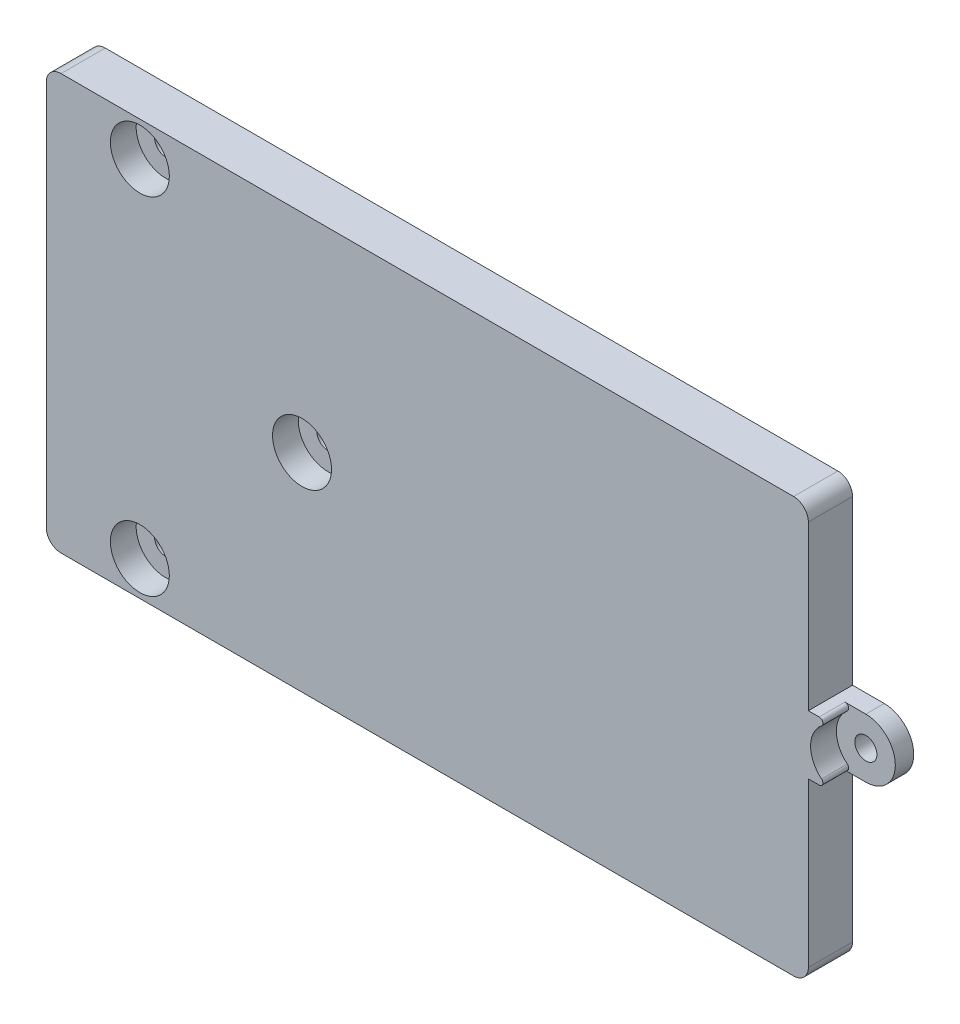
ISO-10303-21;
HEADER;
FILE_DESCRIPTION(('STEP AP214'),'2;1');
FILE_NAME('part.step','',(''),(''),'','','');
FILE_SCHEMA(('AUTOMOTIVE_DESIGN { 1 0 10303 214 1 1 1 1 }'));
ENDSEC;
DATA;
#1=APPLICATION_CONTEXT('core data for automotive mechanical design processes');
#2=APPLICATION_PROTOCOL_DEFINITION('international standard','automotive_design',2000,#1);
#3=PRODUCT_CONTEXT('',#1,'mechanical');
#4=PRODUCT('Part','Part','',(#3));
#5=PRODUCT_RELATED_PRODUCT_CATEGORY('part','',(#4));
#6=PRODUCT_DEFINITION_FORMATION('','',#4);
#7=PRODUCT_DEFINITION_CONTEXT('part definition',#1,'design');
#8=PRODUCT_DEFINITION('design','',#6,#7);
#9=PRODUCT_DEFINITION_SHAPE('','',#8);
#10=(LENGTH_UNIT() NAMED_UNIT(*) SI_UNIT(.MILLI.,.METRE.));
#11=(NAMED_UNIT(*) PLANE_ANGLE_UNIT() SI_UNIT($,.RADIAN.));
#12=(NAMED_UNIT(*) SI_UNIT($,.STERADIAN.) SOLID_ANGLE_UNIT());
#13=UNCERTAINTY_MEASURE_WITH_UNIT(LENGTH_MEASURE(1.E-05),#10,'distance_accuracy_value','');
#14=(GEOMETRIC_REPRESENTATION_CONTEXT(3) GLOBAL_UNCERTAINTY_ASSIGNED_CONTEXT((#13)) GLOBAL_UNIT_ASSIGNED_CONTEXT((#10,
#11,#12)) REPRESENTATION_CONTEXT('',''));
#15=CARTESIAN_POINT('',(0.,0.,0.));
#16=DIRECTION('',(0.,0.,1.));
#17=DIRECTION('',(1.,0.,0.));
#18=AXIS2_PLACEMENT_3D('',#15,#16,#17);
#19=CARTESIAN_POINT('',(28.,0.,-1.5));
#20=DIRECTION('',(0.,0.,1.));
#21=DIRECTION('',(1.,0.,0.));
#22=AXIS2_PLACEMENT_3D('',#19,#20,#21);
#23=CYLINDRICAL_SURFACE('',#22,2.);
#24=DIRECTION('',(0.,0.,1.));
#25=VECTOR('',#24,1.);
#26=CARTESIAN_POINT('',(28.,2.,-1.5));
#27=LINE('',#26,#25);
#28=CARTESIAN_POINT('',(28.,2.,-1.5));
#29=VERTEX_POINT('',#28);
#30=CARTESIAN_POINT('',(28.,2.,-0.25));
#31=VERTEX_POINT('',#30);
#32=EDGE_CURVE('E281',#29,#31,#27,.T.);
#33=ORIENTED_EDGE('',*,*,#32,.T.);
#34=CARTESIAN_POINT('',(28.,0.,-0.25));
#35=DIRECTION('',(0.,0.,1.));
#36=DIRECTION('',(1.,0.,0.));
#37=AXIS2_PLACEMENT_3D('',#34,#35,#36);
#38=CIRCLE('',#37,2.);
#39=CARTESIAN_POINT('',(28.,-2.,-0.25));
#40=VERTEX_POINT('',#39);
#41=EDGE_CURVE('E252',#40,#31,#38,.T.);
#42=ORIENTED_EDGE('',*,*,#41,.F.);
#43=DIRECTION('',(0.,0.,1.));
#44=VECTOR('',#43,1.);
#45=CARTESIAN_POINT('',(28.,-2.,-1.5));
#46=LINE('',#45,#44);
#47=CARTESIAN_POINT('',(28.,-2.,-1.5));
#48=VERTEX_POINT('',#47);
#49=EDGE_CURVE('E280',#48,#40,#46,.T.);
#50=ORIENTED_EDGE('',*,*,#49,.F.);
#51=CARTESIAN_POINT('',(28.,0.,-1.5));
#52=DIRECTION('',(0.,0.,1.));
#53=DIRECTION('',(1.,0.,0.));
#54=AXIS2_PLACEMENT_3D('',#51,#52,#53);
#55=CIRCLE('',#54,2.);
#56=EDGE_CURVE('E275',#48,#29,#55,.T.);
#57=ORIENTED_EDGE('',*,*,#56,.T.);
#58=EDGE_LOOP('',(#33,#42,#50,#57));
#59=FACE_BOUND('',#58,.T.);
#60=ADVANCED_FACE('F36',(#59),#23,.T.);
#61=CARTESIAN_POINT('',(28.,0.,-8.));
#62=DIRECTION('',(0.,0.,1.));
#63=DIRECTION('',(1.,0.,0.));
#64=AXIS2_PLACEMENT_3D('',#61,#62,#63);
#65=CYLINDRICAL_SURFACE('',#64,0.750000000000002);
#66=CARTESIAN_POINT('',(28.,0.,-1.5));
#67=DIRECTION('',(0.,0.,1.));
#68=DIRECTION('',(1.,0.,0.));
#69=AXIS2_PLACEMENT_3D('',#66,#67,#68);
#70=CIRCLE('',#69,0.750000000000002);
#71=CARTESIAN_POINT('',(28.75,0.,-1.5));
#72=VERTEX_POINT('',#71);
#73=EDGE_CURVE('E226',#72,#72,#70,.T.);
#74=ORIENTED_EDGE('',*,*,#73,.F.);
#75=EDGE_LOOP('',(#74));
#76=FACE_BOUND('',#75,.T.);
#77=CARTESIAN_POINT('',(28.,0.,-0.25));
#78=DIRECTION('',(0.,0.,1.));
#79=DIRECTION('',(1.,0.,0.));
#80=AXIS2_PLACEMENT_3D('',#77,#78,#79);
#81=CIRCLE('',#80,0.750000000000002);
#82=CARTESIAN_POINT('',(28.75,0.,-0.25));
#83=VERTEX_POINT('',#82);
#84=EDGE_CURVE('E217',#83,#83,#81,.T.);
#85=ORIENTED_EDGE('',*,*,#84,.T.);
#86=EDGE_LOOP('',(#85));
#87=FACE_BOUND('',#86,.T.);
#88=ADVANCED_FACE('F405',(#76,#87),#65,.F.);
#89=CARTESIAN_POINT('',(-19.5,-11.735,-8.));
#90=DIRECTION('',(0.,0.,1.));
#91=DIRECTION('',(1.,0.,0.));
#92=AXIS2_PLACEMENT_3D('',#89,#90,#91);
#93=CYLINDRICAL_SURFACE('',#92,0.750000000000002);
#94=CARTESIAN_POINT('',(-19.5,-11.735,-1.5));
#95=DIRECTION('',(0.,0.,1.));
#96=DIRECTION('',(1.,0.,0.));
#97=AXIS2_PLACEMENT_3D('',#94,#95,#96);
#98=CIRCLE('',#97,0.750000000000002);
#99=CARTESIAN_POINT('',(-18.75,-11.735,-1.5));
#100=VERTEX_POINT('',#99);
#101=EDGE_CURVE('E257',#100,#100,#98,.T.);
#102=ORIENTED_EDGE('',*,*,#101,.F.);
#103=EDGE_LOOP('',(#102));
#104=FACE_BOUND('',#103,.T.);
#105=CARTESIAN_POINT('',(-19.5,-11.735,-0.25));
#106=DIRECTION('',(0.,0.,1.));
#107=DIRECTION('',(1.,0.,0.));
#108=AXIS2_PLACEMENT_3D('',#105,#106,#107);
#109=CIRCLE('',#108,0.750000000000002);
#110=CARTESIAN_POINT('',(-18.75,-11.735,-0.25));
#111=VERTEX_POINT('',#110);
#112=EDGE_CURVE('E238',#111,#111,#109,.T.);
#113=ORIENTED_EDGE('',*,*,#112,.T.);
#114=EDGE_LOOP('',(#113));
#115=FACE_BOUND('',#114,.T.);
#116=ADVANCED_FACE('F410',(#104,#115),#93,.F.);
#117=CARTESIAN_POINT('',(-8.5,0.,-8.));
#118=DIRECTION('',(0.,0.,1.));
#119=DIRECTION('',(1.,0.,0.));
#120=AXIS2_PLACEMENT_3D('',#117,#118,#119);
#121=CYLINDRICAL_SURFACE('',#120,0.75);
#122=CARTESIAN_POINT('',(-8.5,0.,-1.5));
#123=DIRECTION('',(0.,0.,1.));
#124=DIRECTION('',(1.,0.,0.));
#125=AXIS2_PLACEMENT_3D('',#122,#123,#124);
#126=CIRCLE('',#125,0.75);
#127=CARTESIAN_POINT('',(-7.75,0.,-1.5));
#128=VERTEX_POINT('',#127);
#129=EDGE_CURVE('E260',#128,#128,#126,.T.);
#130=ORIENTED_EDGE('',*,*,#129,.F.);
#131=EDGE_LOOP('',(#130));
#132=FACE_BOUND('',#131,.T.);
#133=CARTESIAN_POINT('',(-8.5,0.,-0.25));
#134=DIRECTION('',(0.,0.,1.));
#135=DIRECTION('',(1.,0.,0.));
#136=AXIS2_PLACEMENT_3D('',#133,#134,#135);
#137=CIRCLE('',#136,0.75);
#138=CARTESIAN_POINT('',(-7.75,0.,-0.25));
#139=VERTEX_POINT('',#138);
#140=EDGE_CURVE('E229',#139,#139,#137,.T.);
#141=ORIENTED_EDGE('',*,*,#140,.T.);
#142=EDGE_LOOP('',(#141));
#143=FACE_BOUND('',#142,.T.);
#144=ADVANCED_FACE('F632',(#132,#143),#121,.F.);
#145=CARTESIAN_POINT('',(-19.5,11.735,-8.));
#146=DIRECTION('',(0.,0.,1.));
#147=DIRECTION('',(1.,0.,0.));
#148=AXIS2_PLACEMENT_3D('',#145,#146,#147);
#149=CYLINDRICAL_SURFACE('',#148,0.750000000000002);
#150=CARTESIAN_POINT('',(-19.5,11.735,-1.5));
#151=DIRECTION('',(0.,0.,1.));
#152=DIRECTION('',(1.,0.,0.));
#153=AXIS2_PLACEMENT_3D('',#150,#151,#152);
#154=CIRCLE('',#153,0.750000000000002);
#155=CARTESIAN_POINT('',(-18.75,11.735,-1.5));
#156=VERTEX_POINT('',#155);
#157=EDGE_CURVE('E263',#156,#156,#154,.T.);
#158=ORIENTED_EDGE('',*,*,#157,.F.);
#159=EDGE_LOOP('',(#158));
#160=FACE_BOUND('',#159,.T.);
#161=CARTESIAN_POINT('',(-19.5,11.735,-0.25));
#162=DIRECTION('',(0.,0.,1.));
#163=DIRECTION('',(1.,0.,0.));
#164=AXIS2_PLACEMENT_3D('',#161,#162,#163);
#165=CIRCLE('',#164,0.750000000000002);
#166=CARTESIAN_POINT('',(-18.75,11.735,-0.25));
#167=VERTEX_POINT('',#166);
#168=EDGE_CURVE('E218',#167,#167,#165,.T.);
#169=ORIENTED_EDGE('',*,*,#168,.T.);
#170=EDGE_LOOP('',(#169));
#171=FACE_BOUND('',#170,.T.);
#172=ADVANCED_FACE('F535',(#160,#171),#149,.F.);
#173=CARTESIAN_POINT('',(0.,2.,-1.5));
#174=DIRECTION('',(0.,-1.,0.));
#175=DIRECTION('',(0.,0.,-1.));
#176=AXIS2_PLACEMENT_3D('',#173,#174,#175);
#177=PLANE('',#176);
#178=DIRECTION('',(1.,0.,0.));
#179=VECTOR('',#178,1.);
#180=CARTESIAN_POINT('',(0.,2.,1.5));
#181=LINE('',#180,#179);
#182=CARTESIAN_POINT('',(25.85,2.,1.5));
#183=VERTEX_POINT('',#182);
#184=CARTESIAN_POINT('',(26.5857864376269,2.,1.5));
#185=VERTEX_POINT('',#184);
#186=EDGE_CURVE('E269',#183,#185,#181,.T.);
#187=ORIENTED_EDGE('',*,*,#186,.T.);
#188=DIRECTION('',(0.,0.,1.));
#189=VECTOR('',#188,1.);
#190=CARTESIAN_POINT('',(26.5857864376269,2.,-1.5));
#191=LINE('',#190,#189);
#192=CARTESIAN_POINT('',(26.5857864376269,2.,-0.25));
#193=VERTEX_POINT('',#192);
#194=EDGE_CURVE('E303',#185,#193,#191,.F.);
#195=ORIENTED_EDGE('',*,*,#194,.T.);
#196=DIRECTION('',(1.,0.,0.));
#197=VECTOR('',#196,1.);
#198=CARTESIAN_POINT('',(28.,2.,-0.25));
#199=LINE('',#198,#197);
#200=EDGE_CURVE('E301',#193,#31,#199,.T.);
#201=ORIENTED_EDGE('',*,*,#200,.T.);
#202=ORIENTED_EDGE('',*,*,#32,.F.);
#203=DIRECTION('',(1.,0.,0.));
#204=VECTOR('',#203,1.);
#205=CARTESIAN_POINT('',(0.,2.,-1.5));
#206=LINE('',#205,#204);
#207=CARTESIAN_POINT('',(25.85,2.,-1.5));
#208=VERTEX_POINT('',#207);
#209=EDGE_CURVE('E278',#208,#29,#206,.T.);
#210=ORIENTED_EDGE('',*,*,#209,.F.);
#211=DIRECTION('',(0.,0.,1.));
#212=VECTOR('',#211,1.);
#213=CARTESIAN_POINT('',(25.85,2.,-5.49999999999999));
#214=LINE('',#213,#212);
#215=EDGE_CURVE('E199',#208,#183,#214,.T.);
#216=ORIENTED_EDGE('',*,*,#215,.T.);
#217=EDGE_LOOP('',(#187,#195,#201,#202,#210,#216));
#218=FACE_BOUND('',#217,.T.);
#219=ADVANCED_FACE('F368',(#218),#177,.F.);
#220=CARTESIAN_POINT('',(0.,-2.,-1.5));
#221=DIRECTION('',(0.,-1.,0.));
#222=DIRECTION('',(0.,0.,-1.));
#223=AXIS2_PLACEMENT_3D('',#220,#221,#222);
#224=PLANE('',#223);
#225=DIRECTION('',(-1.,0.,0.));
#226=VECTOR('',#225,1.);
#227=CARTESIAN_POINT('',(0.,-2.,-0.25));
#228=LINE('',#227,#226);
#229=CARTESIAN_POINT('',(26.5857864376269,-2.,-0.25));
#230=VERTEX_POINT('',#229);
#231=EDGE_CURVE('E284',#40,#230,#228,.T.);
#232=ORIENTED_EDGE('',*,*,#231,.T.);
#233=DIRECTION('',(0.,0.,-1.));
#234=VECTOR('',#233,1.);
#235=CARTESIAN_POINT('',(26.5857864376269,-2.,1.5));
#236=LINE('',#235,#234);
#237=CARTESIAN_POINT('',(26.5857864376269,-2.,1.5));
#238=VERTEX_POINT('',#237);
#239=EDGE_CURVE('E289',#230,#238,#236,.F.);
#240=ORIENTED_EDGE('',*,*,#239,.T.);
#241=DIRECTION('',(1.,0.,0.));
#242=VECTOR('',#241,1.);
#243=CARTESIAN_POINT('',(0.,-2.,1.5));
#244=LINE('',#243,#242);
#245=CARTESIAN_POINT('',(25.85,-2.,1.5));
#246=VERTEX_POINT('',#245);
#247=EDGE_CURVE('E266',#246,#238,#244,.T.);
#248=ORIENTED_EDGE('',*,*,#247,.F.);
#249=DIRECTION('',(0.,0.,1.));
#250=VECTOR('',#249,1.);
#251=CARTESIAN_POINT('',(25.85,-2.,-5.49999999999999));
#252=LINE('',#251,#250);
#253=CARTESIAN_POINT('',(25.85,-2.,-1.5));
#254=VERTEX_POINT('',#253);
#255=EDGE_CURVE('E200',#254,#246,#252,.T.);
#256=ORIENTED_EDGE('',*,*,#255,.F.);
#257=DIRECTION('',(1.,0.,0.));
#258=VECTOR('',#257,1.);
#259=CARTESIAN_POINT('',(0.,-2.,-1.5));
#260=LINE('',#259,#258);
#261=EDGE_CURVE('E272',#254,#48,#260,.T.);
#262=ORIENTED_EDGE('',*,*,#261,.T.);
#263=ORIENTED_EDGE('',*,*,#49,.T.);
#264=EDGE_LOOP('',(#232,#240,#248,#256,#262,#263));
#265=FACE_BOUND('',#264,.T.);
#266=ADVANCED_FACE('F376',(#265),#224,.T.);
#267=CARTESIAN_POINT('',(0.,0.,-1.5));
#268=DIRECTION('',(0.,0.,1.));
#269=DIRECTION('',(1.,0.,0.));
#270=AXIS2_PLACEMENT_3D('',#267,#268,#269);
#271=PLANE('',#270);
#272=ORIENTED_EDGE('',*,*,#157,.T.);
#273=EDGE_LOOP('',(#272));
#274=FACE_BOUND('',#273,.T.);
#275=ORIENTED_EDGE('',*,*,#129,.T.);
#276=EDGE_LOOP('',(#275));
#277=FACE_BOUND('',#276,.T.);
#278=ORIENTED_EDGE('',*,*,#101,.T.);
#279=EDGE_LOOP('',(#278));
#280=FACE_BOUND('',#279,.T.);
#281=ORIENTED_EDGE('',*,*,#73,.T.);
#282=EDGE_LOOP('',(#281));
#283=FACE_BOUND('',#282,.T.);
#284=DIRECTION('',(0.,1.,0.));
#285=VECTOR('',#284,1.);
#286=CARTESIAN_POINT('',(25.85,0.,-1.5));
#287=LINE('',#286,#285);
#288=CARTESIAN_POINT('',(25.85,-13.085,-1.5));
#289=VERTEX_POINT('',#288);
#290=EDGE_CURVE('E215',#289,#254,#287,.T.);
#291=ORIENTED_EDGE('',*,*,#290,.F.);
#292=CARTESIAN_POINT('',(24.85,-13.085,-1.5));
#293=DIRECTION('',(0.,0.,1.));
#294=DIRECTION('',(1.,0.,0.));
#295=AXIS2_PLACEMENT_3D('',#292,#293,#294);
#296=CIRCLE('',#295,1.);
#297=CARTESIAN_POINT('',(24.85,-14.085,-1.5));
#298=VERTEX_POINT('',#297);
#299=EDGE_CURVE('E329',#289,#298,#296,.F.);
#300=ORIENTED_EDGE('',*,*,#299,.T.);
#301=DIRECTION('',(1.,0.,0.));
#302=VECTOR('',#301,1.);
#303=CARTESIAN_POINT('',(0.,-14.085,-1.5));
#304=LINE('',#303,#302);
#305=CARTESIAN_POINT('',(-24.85,-14.085,-1.5));
#306=VERTEX_POINT('',#305);
#307=EDGE_CURVE('E203',#306,#298,#304,.T.);
#308=ORIENTED_EDGE('',*,*,#307,.F.);
#309=CARTESIAN_POINT('',(-24.85,-13.085,-1.5));
#310=DIRECTION('',(0.,0.,1.));
#311=DIRECTION('',(1.,0.,0.));
#312=AXIS2_PLACEMENT_3D('',#309,#310,#311);
#313=CIRCLE('',#312,1.);
#314=CARTESIAN_POINT('',(-25.85,-13.085,-1.5));
#315=VERTEX_POINT('',#314);
#316=EDGE_CURVE('E51',#306,#315,#313,.F.);
#317=ORIENTED_EDGE('',*,*,#316,.T.);
#318=DIRECTION('',(0.,-1.,0.));
#319=VECTOR('',#318,1.);
#320=CARTESIAN_POINT('',(-25.85,0.,-1.5));
#321=LINE('',#320,#319);
#322=CARTESIAN_POINT('',(-25.85,-2.74954541697351,-1.5));
#323=VERTEX_POINT('',#322);
#324=EDGE_CURVE('E180',#323,#315,#321,.T.);
#325=ORIENTED_EDGE('',*,*,#324,.F.);
#326=DIRECTION('',(-1.,0.,0.));
#327=VECTOR('',#326,1.);
#328=CARTESIAN_POINT('',(-10.85,-2.74954541697351,-1.5));
#329=LINE('',#328,#327);
#330=CARTESIAN_POINT('',(-10.85,-2.74954541697351,-1.5));
#331=VERTEX_POINT('',#330);
#332=EDGE_CURVE('E174',#331,#323,#329,.T.);
#333=ORIENTED_EDGE('',*,*,#332,.F.);
#334=DIRECTION('',(0.,-1.,0.));
#335=VECTOR('',#334,1.);
#336=CARTESIAN_POINT('',(-10.85,0.,-1.5));
#337=LINE('',#336,#335);
#338=CARTESIAN_POINT('',(-10.85,2.7495454169735,-1.5));
#339=VERTEX_POINT('',#338);
#340=EDGE_CURVE('E163',#339,#331,#337,.T.);
#341=ORIENTED_EDGE('',*,*,#340,.F.);
#342=DIRECTION('',(-1.,0.,0.));
#343=VECTOR('',#342,1.);
#344=CARTESIAN_POINT('',(-10.85,2.7495454169735,-1.5));
#345=LINE('',#344,#343);
#346=CARTESIAN_POINT('',(-25.85,2.7495454169735,-1.5));
#347=VERTEX_POINT('',#346);
#348=EDGE_CURVE('E176',#339,#347,#345,.T.);
#349=ORIENTED_EDGE('',*,*,#348,.T.);
#350=CARTESIAN_POINT('',(-25.85,13.085,-1.5));
#351=VERTEX_POINT('',#350);
#352=EDGE_CURVE('E208',#351,#347,#321,.T.);
#353=ORIENTED_EDGE('',*,*,#352,.F.);
#354=CARTESIAN_POINT('',(-24.85,13.085,-1.5));
#355=DIRECTION('',(0.,0.,1.));
#356=DIRECTION('',(1.,0.,0.));
#357=AXIS2_PLACEMENT_3D('',#354,#355,#356);
#358=CIRCLE('',#357,1.);
#359=CARTESIAN_POINT('',(-24.85,14.085,-1.5));
#360=VERTEX_POINT('',#359);
#361=EDGE_CURVE('E326',#351,#360,#358,.F.);
#362=ORIENTED_EDGE('',*,*,#361,.T.);
#363=DIRECTION('',(-1.,0.,0.));
#364=VECTOR('',#363,1.);
#365=CARTESIAN_POINT('',(0.,14.085,-1.5));
#366=LINE('',#365,#364);
#367=CARTESIAN_POINT('',(24.85,14.085,-1.5));
#368=VERTEX_POINT('',#367);
#369=EDGE_CURVE('E210',#368,#360,#366,.T.);
#370=ORIENTED_EDGE('',*,*,#369,.F.);
#371=CARTESIAN_POINT('',(24.85,13.085,-1.5));
#372=DIRECTION('',(0.,0.,1.));
#373=DIRECTION('',(1.,0.,0.));
#374=AXIS2_PLACEMENT_3D('',#371,#372,#373);
#375=CIRCLE('',#374,1.);
#376=CARTESIAN_POINT('',(25.85,13.085,-1.5));
#377=VERTEX_POINT('',#376);
#378=EDGE_CURVE('E58',#368,#377,#375,.F.);
#379=ORIENTED_EDGE('',*,*,#378,.T.);
#380=DIRECTION('',(0.,1.,0.));
#381=VECTOR('',#380,1.);
#382=CARTESIAN_POINT('',(25.85,0.,-1.5));
#383=LINE('',#382,#381);
#384=EDGE_CURVE('E213',#208,#377,#383,.T.);
#385=ORIENTED_EDGE('',*,*,#384,.F.);
#386=ORIENTED_EDGE('',*,*,#209,.T.);
#387=ORIENTED_EDGE('',*,*,#56,.F.);
#388=ORIENTED_EDGE('',*,*,#261,.F.);
#389=EDGE_LOOP('',(#291,#300,#308,#317,#325,#333,#341,#349,#353,#362,#370,#379,#385,#386,#387,#388));
#390=FACE_BOUND('',#389,.T.);
#391=ADVANCED_FACE('F179',(#274,#277,#280,#283,#390),#271,.F.);
#392=CARTESIAN_POINT('',(0.,0.,1.5));
#393=DIRECTION('',(0.,0.,1.));
#394=DIRECTION('',(1.,0.,0.));
#395=AXIS2_PLACEMENT_3D('',#392,#393,#394);
#396=PLANE('',#395);
#397=DIRECTION('',(1.,0.,0.));
#398=VECTOR('',#397,1.);
#399=CARTESIAN_POINT('',(0.,-14.085,1.5));
#400=LINE('',#399,#398);
#401=CARTESIAN_POINT('',(-24.85,-14.085,1.5));
#402=VERTEX_POINT('',#401);
#403=CARTESIAN_POINT('',(24.85,-14.085,1.5));
#404=VERTEX_POINT('',#403);
#405=EDGE_CURVE('E187',#402,#404,#400,.T.);
#406=ORIENTED_EDGE('',*,*,#405,.T.);
#407=CARTESIAN_POINT('',(24.85,-13.085,1.5));
#408=DIRECTION('',(0.,0.,1.));
#409=DIRECTION('',(1.,0.,0.));
#410=AXIS2_PLACEMENT_3D('',#407,#408,#409);
#411=CIRCLE('',#410,1.);
#412=CARTESIAN_POINT('',(25.85,-13.085,1.5));
#413=VERTEX_POINT('',#412);
#414=EDGE_CURVE('E321',#404,#413,#411,.T.);
#415=ORIENTED_EDGE('',*,*,#414,.T.);
#416=DIRECTION('',(0.,1.,0.));
#417=VECTOR('',#416,1.);
#418=CARTESIAN_POINT('',(25.85,0.,1.5));
#419=LINE('',#418,#417);
#420=EDGE_CURVE('E182',#413,#246,#419,.T.);
#421=ORIENTED_EDGE('',*,*,#420,.T.);
#422=ORIENTED_EDGE('',*,*,#247,.T.);
#423=CARTESIAN_POINT('',(26.5857864376269,-1.75,1.5));
#424=DIRECTION('',(0.,0.,1.));
#425=DIRECTION('',(1.,0.,0.));
#426=AXIS2_PLACEMENT_3D('',#423,#424,#425);
#427=CIRCLE('',#426,0.25);
#428=CARTESIAN_POINT('',(26.7429212778906,-1.55555555555556,1.5));
#429=VERTEX_POINT('',#428);
#430=EDGE_CURVE('E294',#238,#429,#427,.T.);
#431=ORIENTED_EDGE('',*,*,#430,.T.);
#432=CARTESIAN_POINT('',(28.,0.,1.5));
#433=DIRECTION('',(0.,0.,1.));
#434=DIRECTION('',(1.,0.,0.));
#435=AXIS2_PLACEMENT_3D('',#432,#433,#434);
#436=CIRCLE('',#435,2.);
#437=CARTESIAN_POINT('',(26.7429212778906,1.55555555555556,1.5));
#438=VERTEX_POINT('',#437);
#439=EDGE_CURVE('E249',#438,#429,#436,.T.);
#440=ORIENTED_EDGE('',*,*,#439,.F.);
#441=CARTESIAN_POINT('',(26.5857864376269,1.75,1.5));
#442=DIRECTION('',(0.,0.,1.));
#443=DIRECTION('',(1.,0.,0.));
#444=AXIS2_PLACEMENT_3D('',#441,#442,#443);
#445=CIRCLE('',#444,0.25);
#446=EDGE_CURVE('E292',#438,#185,#445,.T.);
#447=ORIENTED_EDGE('',*,*,#446,.T.);
#448=ORIENTED_EDGE('',*,*,#186,.F.);
#449=DIRECTION('',(0.,1.,0.));
#450=VECTOR('',#449,1.);
#451=CARTESIAN_POINT('',(25.85,0.,1.5));
#452=LINE('',#451,#450);
#453=CARTESIAN_POINT('',(25.85,13.085,1.5));
#454=VERTEX_POINT('',#453);
#455=EDGE_CURVE('E196',#183,#454,#452,.T.);
#456=ORIENTED_EDGE('',*,*,#455,.T.);
#457=CARTESIAN_POINT('',(24.85,13.085,1.5));
#458=DIRECTION('',(0.,0.,1.));
#459=DIRECTION('',(1.,0.,0.));
#460=AXIS2_PLACEMENT_3D('',#457,#458,#459);
#461=CIRCLE('',#460,1.);
#462=CARTESIAN_POINT('',(24.85,14.085,1.5));
#463=VERTEX_POINT('',#462);
#464=EDGE_CURVE('E319',#454,#463,#461,.T.);
#465=ORIENTED_EDGE('',*,*,#464,.T.);
#466=DIRECTION('',(-1.,0.,0.));
#467=VECTOR('',#466,1.);
#468=CARTESIAN_POINT('',(0.,14.085,1.5));
#469=LINE('',#468,#467);
#470=CARTESIAN_POINT('',(-24.85,14.085,1.5));
#471=VERTEX_POINT('',#470);
#472=EDGE_CURVE('E193',#463,#471,#469,.T.);
#473=ORIENTED_EDGE('',*,*,#472,.T.);
#474=CARTESIAN_POINT('',(-24.85,13.085,1.5));
#475=DIRECTION('',(0.,0.,1.));
#476=DIRECTION('',(1.,0.,0.));
#477=AXIS2_PLACEMENT_3D('',#474,#475,#476);
#478=CIRCLE('',#477,1.);
#479=CARTESIAN_POINT('',(-25.85,13.085,1.5));
#480=VERTEX_POINT('',#479);
#481=EDGE_CURVE('E317',#471,#480,#478,.T.);
#482=ORIENTED_EDGE('',*,*,#481,.T.);
#483=DIRECTION('',(0.,-1.,0.));
#484=VECTOR('',#483,1.);
#485=CARTESIAN_POINT('',(-25.85,0.,1.5));
#486=LINE('',#485,#484);
#487=CARTESIAN_POINT('',(-25.85,-13.085,1.5));
#488=VERTEX_POINT('',#487);
#489=EDGE_CURVE('E190',#480,#488,#486,.T.);
#490=ORIENTED_EDGE('',*,*,#489,.T.);
#491=CARTESIAN_POINT('',(-24.85,-13.085,1.5));
#492=DIRECTION('',(0.,0.,1.));
#493=DIRECTION('',(1.,0.,0.));
#494=AXIS2_PLACEMENT_3D('',#491,#492,#493);
#495=CIRCLE('',#494,1.);
#496=EDGE_CURVE('E315',#488,#402,#495,.T.);
#497=ORIENTED_EDGE('',*,*,#496,.T.);
#498=EDGE_LOOP('',(#406,#415,#421,#422,#431,#440,#447,#448,#456,#465,#473,#482,#490,#497));
#499=FACE_BOUND('',#498,.T.);
#500=CARTESIAN_POINT('',(-19.5,11.735,1.5));
#501=DIRECTION('',(0.,0.,1.));
#502=DIRECTION('',(1.,0.,0.));
#503=AXIS2_PLACEMENT_3D('',#500,#501,#502);
#504=CIRCLE('',#503,2.);
#505=CARTESIAN_POINT('',(-17.5,11.735,1.5));
#506=VERTEX_POINT('',#505);
#507=EDGE_CURVE('E221',#506,#506,#504,.T.);
#508=ORIENTED_EDGE('',*,*,#507,.F.);
#509=EDGE_LOOP('',(#508));
#510=FACE_BOUND('',#509,.T.);
#511=CARTESIAN_POINT('',(-8.5,0.,1.5));
#512=DIRECTION('',(0.,0.,1.));
#513=DIRECTION('',(1.,0.,0.));
#514=AXIS2_PLACEMENT_3D('',#511,#512,#513);
#515=CIRCLE('',#514,2.);
#516=CARTESIAN_POINT('',(-6.5,0.,1.5));
#517=VERTEX_POINT('',#516);
#518=EDGE_CURVE('E232',#517,#517,#515,.T.);
#519=ORIENTED_EDGE('',*,*,#518,.F.);
#520=EDGE_LOOP('',(#519));
#521=FACE_BOUND('',#520,.T.);
#522=CARTESIAN_POINT('',(-19.5,-11.735,1.5));
#523=DIRECTION('',(0.,0.,1.));
#524=DIRECTION('',(1.,0.,0.));
#525=AXIS2_PLACEMENT_3D('',#522,#523,#524);
#526=CIRCLE('',#525,2.);
#527=CARTESIAN_POINT('',(-17.5,-11.735,1.5));
#528=VERTEX_POINT('',#527);
#529=EDGE_CURVE('E241',#528,#528,#526,.T.);
#530=ORIENTED_EDGE('',*,*,#529,.F.);
#531=EDGE_LOOP('',(#530));
#532=FACE_BOUND('',#531,.T.);
#533=ADVANCED_FACE('F346',(#499,#510,#521,#532),#396,.T.);
#534=CARTESIAN_POINT('',(-19.5,11.735,-0.25));
#535=DIRECTION('',(0.,0.,1.));
#536=DIRECTION('',(1.,0.,0.));
#537=AXIS2_PLACEMENT_3D('',#534,#535,#536);
#538=CYLINDRICAL_SURFACE('',#537,2.);
#539=CARTESIAN_POINT('',(-19.5,11.735,-0.25));
#540=DIRECTION('',(0.,0.,1.));
#541=DIRECTION('',(1.,0.,0.));
#542=AXIS2_PLACEMENT_3D('',#539,#540,#541);
#543=CIRCLE('',#542,2.);
#544=CARTESIAN_POINT('',(-17.5,11.735,-0.25));
#545=VERTEX_POINT('',#544);
#546=EDGE_CURVE('E223',#545,#545,#543,.T.);
#547=ORIENTED_EDGE('',*,*,#546,.F.);
#548=EDGE_LOOP('',(#547));
#549=FACE_BOUND('',#548,.T.);
#550=ORIENTED_EDGE('',*,*,#507,.T.);
#551=EDGE_LOOP('',(#550));
#552=FACE_BOUND('',#551,.T.);
#553=ADVANCED_FACE('F494',(#549,#552),#538,.F.);
#554=CARTESIAN_POINT('',(-19.5,11.735,-0.25));
#555=DIRECTION('',(0.,0.,1.));
#556=DIRECTION('',(1.,0.,0.));
#557=AXIS2_PLACEMENT_3D('',#554,#555,#556);
#558=PLANE('',#557);
#559=ORIENTED_EDGE('',*,*,#168,.F.);
#560=EDGE_LOOP('',(#559));
#561=FACE_BOUND('',#560,.T.);
#562=ORIENTED_EDGE('',*,*,#546,.T.);
#563=EDGE_LOOP('',(#562));
#564=FACE_BOUND('',#563,.T.);
#565=ADVANCED_FACE('F607',(#561,#564),#558,.T.);
#566=CARTESIAN_POINT('',(-8.5,0.,-0.25));
#567=DIRECTION('',(0.,0.,1.));
#568=DIRECTION('',(1.,0.,0.));
#569=AXIS2_PLACEMENT_3D('',#566,#567,#568);
#570=CYLINDRICAL_SURFACE('',#569,2.);
#571=CARTESIAN_POINT('',(-8.5,0.,-0.25));
#572=DIRECTION('',(0.,0.,1.));
#573=DIRECTION('',(1.,0.,0.));
#574=AXIS2_PLACEMENT_3D('',#571,#572,#573);
#575=CIRCLE('',#574,2.);
#576=CARTESIAN_POINT('',(-6.5,0.,-0.25));
#577=VERTEX_POINT('',#576);
#578=EDGE_CURVE('E222',#577,#577,#575,.T.);
#579=ORIENTED_EDGE('',*,*,#578,.F.);
#580=EDGE_LOOP('',(#579));
#581=FACE_BOUND('',#580,.T.);
#582=ORIENTED_EDGE('',*,*,#518,.T.);
#583=EDGE_LOOP('',(#582));
#584=FACE_BOUND('',#583,.T.);
#585=ADVANCED_FACE('F597',(#581,#584),#570,.F.);
#586=CARTESIAN_POINT('',(-8.5,0.,-0.25));
#587=DIRECTION('',(0.,0.,1.));
#588=DIRECTION('',(1.,0.,0.));
#589=AXIS2_PLACEMENT_3D('',#586,#587,#588);
#590=PLANE('',#589);
#591=ORIENTED_EDGE('',*,*,#140,.F.);
#592=EDGE_LOOP('',(#591));
#593=FACE_BOUND('',#592,.T.);
#594=ORIENTED_EDGE('',*,*,#578,.T.);
#595=EDGE_LOOP('',(#594));
#596=FACE_BOUND('',#595,.T.);
#597=ADVANCED_FACE('F587',(#593,#596),#590,.T.);
#598=CARTESIAN_POINT('',(-19.5,-11.735,-0.25));
#599=DIRECTION('',(0.,0.,1.));
#600=DIRECTION('',(1.,0.,0.));
#601=AXIS2_PLACEMENT_3D('',#598,#599,#600);
#602=CYLINDRICAL_SURFACE('',#601,2.);
#603=CARTESIAN_POINT('',(-19.5,-11.735,-0.25));
#604=DIRECTION('',(0.,0.,1.));
#605=DIRECTION('',(1.,0.,0.));
#606=AXIS2_PLACEMENT_3D('',#603,#604,#605);
#607=CIRCLE('',#606,2.);
#608=CARTESIAN_POINT('',(-17.5,-11.735,-0.25));
#609=VERTEX_POINT('',#608);
#610=EDGE_CURVE('E233',#609,#609,#607,.T.);
#611=ORIENTED_EDGE('',*,*,#610,.F.);
#612=EDGE_LOOP('',(#611));
#613=FACE_BOUND('',#612,.T.);
#614=ORIENTED_EDGE('',*,*,#529,.T.);
#615=EDGE_LOOP('',(#614));
#616=FACE_BOUND('',#615,.T.);
#617=ADVANCED_FACE('F577',(#613,#616),#602,.F.);
#618=CARTESIAN_POINT('',(-19.5,-11.735,-0.25));
#619=DIRECTION('',(0.,0.,1.));
#620=DIRECTION('',(1.,0.,0.));
#621=AXIS2_PLACEMENT_3D('',#618,#619,#620);
#622=PLANE('',#621);
#623=ORIENTED_EDGE('',*,*,#112,.F.);
#624=EDGE_LOOP('',(#623));
#625=FACE_BOUND('',#624,.T.);
#626=ORIENTED_EDGE('',*,*,#610,.T.);
#627=EDGE_LOOP('',(#626));
#628=FACE_BOUND('',#627,.T.);
#629=ADVANCED_FACE('F567',(#625,#628),#622,.T.);
#630=CARTESIAN_POINT('',(28.,0.,-0.25));
#631=DIRECTION('',(0.,0.,1.));
#632=DIRECTION('',(1.,0.,0.));
#633=AXIS2_PLACEMENT_3D('',#630,#631,#632);
#634=CYLINDRICAL_SURFACE('',#633,2.);
#635=ORIENTED_EDGE('',*,*,#439,.T.);
#636=DIRECTION('',(0.,0.,1.));
#637=VECTOR('',#636,1.);
#638=CARTESIAN_POINT('',(26.7429212778906,-1.55555555555556,-0.25));
#639=LINE('',#638,#637);
#640=CARTESIAN_POINT('',(26.7429212778906,-1.55555555555556,-0.25));
#641=VERTEX_POINT('',#640);
#642=EDGE_CURVE('E299',#429,#641,#639,.F.);
#643=ORIENTED_EDGE('',*,*,#642,.T.);
#644=CARTESIAN_POINT('',(26.7429212778906,1.55555555555556,-0.25));
#645=VERTEX_POINT('',#644);
#646=EDGE_CURVE('E242',#645,#641,#38,.T.);
#647=ORIENTED_EDGE('',*,*,#646,.F.);
#648=DIRECTION('',(0.,0.,1.));
#649=VECTOR('',#648,1.);
#650=CARTESIAN_POINT('',(26.7429212778906,1.55555555555556,-0.25));
#651=LINE('',#650,#649);
#652=EDGE_CURVE('E296',#645,#438,#651,.T.);
#653=ORIENTED_EDGE('',*,*,#652,.T.);
#654=EDGE_LOOP('',(#635,#643,#647,#653));
#655=FACE_BOUND('',#654,.T.);
#656=ADVANCED_FACE('F557',(#655),#634,.F.);
#657=CARTESIAN_POINT('',(28.,0.,-0.25));
#658=DIRECTION('',(0.,0.,1.));
#659=DIRECTION('',(1.,0.,0.));
#660=AXIS2_PLACEMENT_3D('',#657,#658,#659);
#661=PLANE('',#660);
#662=ORIENTED_EDGE('',*,*,#84,.F.);
#663=EDGE_LOOP('',(#662));
#664=FACE_BOUND('',#663,.T.);
#665=ORIENTED_EDGE('',*,*,#41,.T.);
#666=ORIENTED_EDGE('',*,*,#200,.F.);
#667=CARTESIAN_POINT('',(26.5857864376269,1.75,-0.25));
#668=DIRECTION('',(0.,0.,1.));
#669=DIRECTION('',(1.,0.,0.));
#670=AXIS2_PLACEMENT_3D('',#667,#668,#669);
#671=CIRCLE('',#670,0.25);
#672=EDGE_CURVE('E308',#193,#645,#671,.F.);
#673=ORIENTED_EDGE('',*,*,#672,.T.);
#674=ORIENTED_EDGE('',*,*,#646,.T.);
#675=CARTESIAN_POINT('',(26.5857864376269,-1.75,-0.25));
#676=DIRECTION('',(0.,0.,1.));
#677=DIRECTION('',(1.,0.,0.));
#678=AXIS2_PLACEMENT_3D('',#675,#676,#677);
#679=CIRCLE('',#678,0.25);
#680=EDGE_CURVE('E306',#641,#230,#679,.F.);
#681=ORIENTED_EDGE('',*,*,#680,.T.);
#682=ORIENTED_EDGE('',*,*,#231,.F.);
#683=EDGE_LOOP('',(#665,#666,#673,#674,#681,#682));
#684=FACE_BOUND('',#683,.T.);
#685=ADVANCED_FACE('F419',(#664,#684),#661,.T.);
#686=CARTESIAN_POINT('',(26.5857864376269,-1.75,-0.25));
#687=DIRECTION('',(0.,0.,1.));
#688=DIRECTION('',(1.,0.,0.));
#689=AXIS2_PLACEMENT_3D('',#686,#687,#688);
#690=CYLINDRICAL_SURFACE('',#689,0.25);
#691=ORIENTED_EDGE('',*,*,#680,.F.);
#692=ORIENTED_EDGE('',*,*,#642,.F.);
#693=ORIENTED_EDGE('',*,*,#430,.F.);
#694=ORIENTED_EDGE('',*,*,#239,.F.);
#695=EDGE_LOOP('',(#691,#692,#693,#694));
#696=FACE_BOUND('',#695,.T.);
#697=ADVANCED_FACE('F399',(#696),#690,.T.);
#698=CARTESIAN_POINT('',(26.5857864376269,1.75,-0.25));
#699=DIRECTION('',(0.,0.,1.));
#700=DIRECTION('',(1.,0.,0.));
#701=AXIS2_PLACEMENT_3D('',#698,#699,#700);
#702=CYLINDRICAL_SURFACE('',#701,0.25);
#703=ORIENTED_EDGE('',*,*,#672,.F.);
#704=ORIENTED_EDGE('',*,*,#194,.F.);
#705=ORIENTED_EDGE('',*,*,#446,.F.);
#706=ORIENTED_EDGE('',*,*,#652,.F.);
#707=EDGE_LOOP('',(#703,#704,#705,#706));
#708=FACE_BOUND('',#707,.T.);
#709=ADVANCED_FACE('F392',(#708),#702,.T.);
#710=CARTESIAN_POINT('',(25.85,0.,-5.49999999999999));
#711=DIRECTION('',(1.,0.,0.));
#712=DIRECTION('',(0.,0.,-1.));
#713=AXIS2_PLACEMENT_3D('',#710,#711,#712);
#714=PLANE('',#713);
#715=ORIENTED_EDGE('',*,*,#420,.F.);
#716=DIRECTION('',(0.,0.,1.));
#717=VECTOR('',#716,1.);
#718=CARTESIAN_POINT('',(25.85,-13.085,-5.49999999999999));
#719=LINE('',#718,#717);
#720=EDGE_CURVE('E323',#413,#289,#719,.F.);
#721=ORIENTED_EDGE('',*,*,#720,.T.);
#722=ORIENTED_EDGE('',*,*,#290,.T.);
#723=ORIENTED_EDGE('',*,*,#255,.T.);
#724=EDGE_LOOP('',(#715,#721,#722,#723));
#725=FACE_BOUND('',#724,.T.);
#726=ADVANCED_FACE('F390',(#725),#714,.T.);
#727=CARTESIAN_POINT('',(25.85,0.,-5.49999999999999));
#728=DIRECTION('',(1.,0.,0.));
#729=DIRECTION('',(0.,0.,-1.));
#730=AXIS2_PLACEMENT_3D('',#727,#728,#729);
#731=PLANE('',#730);
#732=ORIENTED_EDGE('',*,*,#384,.T.);
#733=DIRECTION('',(0.,0.,1.));
#734=VECTOR('',#733,1.);
#735=CARTESIAN_POINT('',(25.85,13.085,-5.49999999999999));
#736=LINE('',#735,#734);
#737=EDGE_CURVE('E331',#377,#454,#736,.T.);
#738=ORIENTED_EDGE('',*,*,#737,.T.);
#739=ORIENTED_EDGE('',*,*,#455,.F.);
#740=ORIENTED_EDGE('',*,*,#215,.F.);
#741=EDGE_LOOP('',(#732,#738,#739,#740));
#742=FACE_BOUND('',#741,.T.);
#743=ADVANCED_FACE('F363',(#742),#731,.T.);
#744=CARTESIAN_POINT('',(0.,14.085,-5.49999999999999));
#745=DIRECTION('',(0.,1.,0.));
#746=DIRECTION('',(-1.,0.,0.));
#747=AXIS2_PLACEMENT_3D('',#744,#745,#746);
#748=PLANE('',#747);
#749=ORIENTED_EDGE('',*,*,#472,.F.);
#750=DIRECTION('',(0.,0.,1.));
#751=VECTOR('',#750,1.);
#752=CARTESIAN_POINT('',(24.85,14.085,-5.49999999999999));
#753=LINE('',#752,#751);
#754=EDGE_CURVE('E337',#463,#368,#753,.F.);
#755=ORIENTED_EDGE('',*,*,#754,.T.);
#756=ORIENTED_EDGE('',*,*,#369,.T.);
#757=DIRECTION('',(0.,0.,1.));
#758=VECTOR('',#757,1.);
#759=CARTESIAN_POINT('',(-24.85,14.085,-5.49999999999999));
#760=LINE('',#759,#758);
#761=EDGE_CURVE('E334',#360,#471,#760,.T.);
#762=ORIENTED_EDGE('',*,*,#761,.T.);
#763=EDGE_LOOP('',(#749,#755,#756,#762));
#764=FACE_BOUND('',#763,.T.);
#765=ADVANCED_FACE('F355',(#764),#748,.T.);
#766=CARTESIAN_POINT('',(-25.85,0.,-5.49999999999999));
#767=DIRECTION('',(-1.,0.,0.));
#768=DIRECTION('',(0.,-1.,0.));
#769=AXIS2_PLACEMENT_3D('',#766,#767,#768);
#770=PLANE('',#769);
#771=ORIENTED_EDGE('',*,*,#489,.F.);
#772=DIRECTION('',(0.,0.,1.));
#773=VECTOR('',#772,1.);
#774=CARTESIAN_POINT('',(-25.85,13.085,-5.49999999999999));
#775=LINE('',#774,#773);
#776=EDGE_CURVE('E11',#480,#351,#775,.F.);
#777=ORIENTED_EDGE('',*,*,#776,.T.);
#778=ORIENTED_EDGE('',*,*,#352,.T.);
#779=CARTESIAN_POINT('',(-25.85,0.,-7.5));
#780=DIRECTION('',(-1.,0.,0.));
#781=DIRECTION('',(0.,0.,1.));
#782=AXIS2_PLACEMENT_3D('',#779,#780,#781);
#783=CIRCLE('',#782,6.6);
#784=EDGE_CURVE('E169',#323,#347,#783,.T.);
#785=ORIENTED_EDGE('',*,*,#784,.F.);
#786=ORIENTED_EDGE('',*,*,#324,.T.);
#787=DIRECTION('',(0.,0.,1.));
#788=VECTOR('',#787,1.);
#789=CARTESIAN_POINT('',(-25.85,-13.085,-5.49999999999999));
#790=LINE('',#789,#788);
#791=EDGE_CURVE('E44',#315,#488,#790,.T.);
#792=ORIENTED_EDGE('',*,*,#791,.T.);
#793=EDGE_LOOP('',(#771,#777,#778,#785,#786,#792));
#794=FACE_BOUND('',#793,.T.);
#795=ADVANCED_FACE('F342',(#794),#770,.T.);
#796=CARTESIAN_POINT('',(0.,-14.085,-5.49999999999999));
#797=DIRECTION('',(0.,-1.,0.));
#798=DIRECTION('',(1.,0.,0.));
#799=AXIS2_PLACEMENT_3D('',#796,#797,#798);
#800=PLANE('',#799);
#801=ORIENTED_EDGE('',*,*,#307,.T.);
#802=DIRECTION('',(0.,0.,1.));
#803=VECTOR('',#802,1.);
#804=CARTESIAN_POINT('',(24.85,-14.085,-5.49999999999999));
#805=LINE('',#804,#803);
#806=EDGE_CURVE('E312',#298,#404,#805,.T.);
#807=ORIENTED_EDGE('',*,*,#806,.T.);
#808=ORIENTED_EDGE('',*,*,#405,.F.);
#809=DIRECTION('',(0.,0.,1.));
#810=VECTOR('',#809,1.);
#811=CARTESIAN_POINT('',(-24.85,-14.085,-5.49999999999999));
#812=LINE('',#811,#810);
#813=EDGE_CURVE('E310',#402,#306,#812,.F.);
#814=ORIENTED_EDGE('',*,*,#813,.T.);
#815=EDGE_LOOP('',(#801,#807,#808,#814));
#816=FACE_BOUND('',#815,.T.);
#817=ADVANCED_FACE('F387',(#816),#800,.T.);
#818=CARTESIAN_POINT('',(-10.85,0.,-7.5));
#819=DIRECTION('',(-1.,0.,0.));
#820=DIRECTION('',(0.,0.,1.));
#821=AXIS2_PLACEMENT_3D('',#818,#819,#820);
#822=CYLINDRICAL_SURFACE('',#821,6.6);
#823=ORIENTED_EDGE('',*,*,#784,.T.);
#824=ORIENTED_EDGE('',*,*,#348,.F.);
#825=CARTESIAN_POINT('',(-10.85,0.,-7.5));
#826=DIRECTION('',(-1.,0.,0.));
#827=DIRECTION('',(0.,0.,1.));
#828=AXIS2_PLACEMENT_3D('',#825,#826,#827);
#829=CIRCLE('',#828,6.6);
#830=EDGE_CURVE('E166',#331,#339,#829,.T.);
#831=ORIENTED_EDGE('',*,*,#830,.F.);
#832=ORIENTED_EDGE('',*,*,#332,.T.);
#833=EDGE_LOOP('',(#823,#824,#831,#832));
#834=FACE_BOUND('',#833,.T.);
#835=ADVANCED_FACE('F173',(#834),#822,.F.);
#836=CARTESIAN_POINT('',(-10.85,0.,0.));
#837=DIRECTION('',(-1.,0.,0.));
#838=DIRECTION('',(0.,0.,1.));
#839=AXIS2_PLACEMENT_3D('',#836,#837,#838);
#840=PLANE('',#839);
#841=ORIENTED_EDGE('',*,*,#340,.T.);
#842=ORIENTED_EDGE('',*,*,#830,.T.);
#843=EDGE_LOOP('',(#841,#842));
#844=FACE_BOUND('',#843,.T.);
#845=ADVANCED_FACE('F165',(#844),#840,.T.);
#846=CARTESIAN_POINT('',(24.85,-13.085,-5.49999999999999));
#847=DIRECTION('',(0.,0.,1.));
#848=DIRECTION('',(1.,0.,0.));
#849=AXIS2_PLACEMENT_3D('',#846,#847,#848);
#850=CYLINDRICAL_SURFACE('',#849,1.);
#851=ORIENTED_EDGE('',*,*,#299,.F.);
#852=ORIENTED_EDGE('',*,*,#720,.F.);
#853=ORIENTED_EDGE('',*,*,#414,.F.);
#854=ORIENTED_EDGE('',*,*,#806,.F.);
#855=EDGE_LOOP('',(#851,#852,#853,#854));
#856=FACE_BOUND('',#855,.T.);
#857=ADVANCED_FACE('F385',(#856),#850,.T.);
#858=CARTESIAN_POINT('',(24.85,13.085,-5.49999999999999));
#859=DIRECTION('',(0.,0.,1.));
#860=DIRECTION('',(1.,0.,0.));
#861=AXIS2_PLACEMENT_3D('',#858,#859,#860);
#862=CYLINDRICAL_SURFACE('',#861,1.);
#863=ORIENTED_EDGE('',*,*,#378,.F.);
#864=ORIENTED_EDGE('',*,*,#754,.F.);
#865=ORIENTED_EDGE('',*,*,#464,.F.);
#866=ORIENTED_EDGE('',*,*,#737,.F.);
#867=EDGE_LOOP('',(#863,#864,#865,#866));
#868=FACE_BOUND('',#867,.T.);
#869=ADVANCED_FACE('F360',(#868),#862,.T.);
#870=CARTESIAN_POINT('',(-24.85,13.085,-5.49999999999999));
#871=DIRECTION('',(0.,0.,1.));
#872=DIRECTION('',(1.,0.,0.));
#873=AXIS2_PLACEMENT_3D('',#870,#871,#872);
#874=CYLINDRICAL_SURFACE('',#873,1.);
#875=ORIENTED_EDGE('',*,*,#361,.F.);
#876=ORIENTED_EDGE('',*,*,#776,.F.);
#877=ORIENTED_EDGE('',*,*,#481,.F.);
#878=ORIENTED_EDGE('',*,*,#761,.F.);
#879=EDGE_LOOP('',(#875,#876,#877,#878));
#880=FACE_BOUND('',#879,.T.);
#881=ADVANCED_FACE('F353',(#880),#874,.T.);
#882=CARTESIAN_POINT('',(-24.85,-13.085,-5.49999999999999));
#883=DIRECTION('',(0.,0.,1.));
#884=DIRECTION('',(1.,0.,0.));
#885=AXIS2_PLACEMENT_3D('',#882,#883,#884);
#886=CYLINDRICAL_SURFACE('',#885,1.);
#887=ORIENTED_EDGE('',*,*,#316,.F.);
#888=ORIENTED_EDGE('',*,*,#813,.F.);
#889=ORIENTED_EDGE('',*,*,#496,.F.);
#890=ORIENTED_EDGE('',*,*,#791,.F.);
#891=EDGE_LOOP('',(#887,#888,#889,#890));
#892=FACE_BOUND('',#891,.T.);
#893=ADVANCED_FACE('F38',(#892),#886,.T.);
#894=CLOSED_SHELL('',(#60,#88,#116,#144,#172,#219,#266,#391,#533,#553,#565,#585,#597,#617,#629,
#656,#685,#697,#709,#726,#743,#765,#795,#817,#835,#845,#857,#869,#881,#893));
#895=MANIFOLD_SOLID_BREP('B2',#894);
#896=ADVANCED_BREP_SHAPE_REPRESENTATION('',(#18,#895),#14);
#897=SHAPE_DEFINITION_REPRESENTATION(#9,#896);
ENDSEC;
END-ISO-10303-21;
